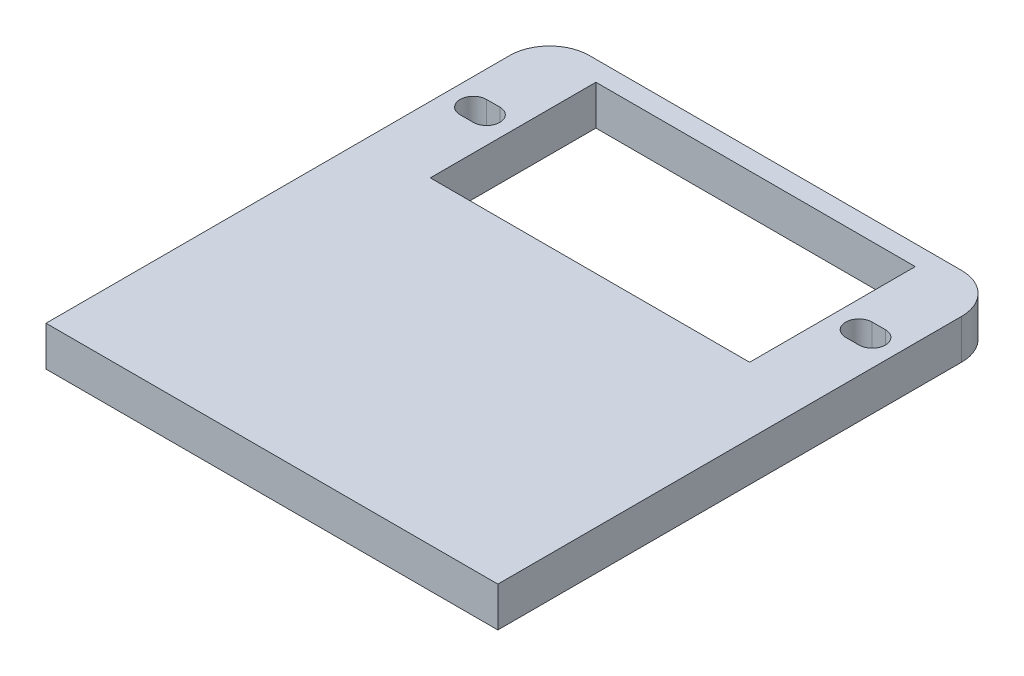
ISO-10303-21;
HEADER;
FILE_DESCRIPTION(('STEP AP214'),'2;1');
FILE_NAME('part.step','',(''),(''),'','','');
FILE_SCHEMA(('AUTOMOTIVE_DESIGN { 1 0 10303 214 1 1 1 1 }'));
ENDSEC;
DATA;
#1=APPLICATION_CONTEXT('core data for automotive mechanical design processes');
#2=APPLICATION_PROTOCOL_DEFINITION('international standard','automotive_design',2000,#1);
#3=PRODUCT_CONTEXT('',#1,'mechanical');
#4=PRODUCT('Part','Part','',(#3));
#5=PRODUCT_RELATED_PRODUCT_CATEGORY('part','',(#4));
#6=PRODUCT_DEFINITION_FORMATION('','',#4);
#7=PRODUCT_DEFINITION_CONTEXT('part definition',#1,'design');
#8=PRODUCT_DEFINITION('design','',#6,#7);
#9=PRODUCT_DEFINITION_SHAPE('','',#8);
#10=(LENGTH_UNIT() NAMED_UNIT(*) SI_UNIT(.MILLI.,.METRE.));
#11=(NAMED_UNIT(*) PLANE_ANGLE_UNIT() SI_UNIT($,.RADIAN.));
#12=(NAMED_UNIT(*) SI_UNIT($,.STERADIAN.) SOLID_ANGLE_UNIT());
#13=UNCERTAINTY_MEASURE_WITH_UNIT(LENGTH_MEASURE(1.E-05),#10,'distance_accuracy_value','');
#14=(GEOMETRIC_REPRESENTATION_CONTEXT(3) GLOBAL_UNCERTAINTY_ASSIGNED_CONTEXT((#13)) GLOBAL_UNIT_ASSIGNED_CONTEXT((#10,
#11,#12)) REPRESENTATION_CONTEXT('',''));
#15=CARTESIAN_POINT('',(0.,0.,0.));
#16=DIRECTION('',(0.,0.,1.));
#17=DIRECTION('',(1.,0.,0.));
#18=AXIS2_PLACEMENT_3D('',#15,#16,#17);
#19=CARTESIAN_POINT('',(0.,3.,-24.));
#20=DIRECTION('',(0.,0.,1.));
#21=DIRECTION('',(1.,0.,0.));
#22=AXIS2_PLACEMENT_3D('',#19,#20,#21);
#23=PLANE('',#22);
#24=DIRECTION('',(-1.,0.,0.));
#25=VECTOR('',#24,1.);
#26=CARTESIAN_POINT('',(0.,0.,-24.));
#27=LINE('',#26,#25);
#28=CARTESIAN_POINT('',(12.05,0.,-24.));
#29=VERTEX_POINT('',#28);
#30=CARTESIAN_POINT('',(-12.05,0.,-24.));
#31=VERTEX_POINT('',#30);
#32=EDGE_CURVE('E263',#29,#31,#27,.T.);
#33=ORIENTED_EDGE('',*,*,#32,.T.);
#34=DIRECTION('',(0.,-1.,0.));
#35=VECTOR('',#34,1.);
#36=CARTESIAN_POINT('',(-12.05,3.,-24.));
#37=LINE('',#36,#35);
#38=CARTESIAN_POINT('',(-12.05,3.,-24.));
#39=VERTEX_POINT('',#38);
#40=EDGE_CURVE('E283',#39,#31,#37,.T.);
#41=ORIENTED_EDGE('',*,*,#40,.F.);
#42=DIRECTION('',(-1.,0.,0.));
#43=VECTOR('',#42,1.);
#44=CARTESIAN_POINT('',(0.,3.,-24.));
#45=LINE('',#44,#43);
#46=CARTESIAN_POINT('',(12.05,3.,-24.));
#47=VERTEX_POINT('',#46);
#48=EDGE_CURVE('E235',#47,#39,#45,.T.);
#49=ORIENTED_EDGE('',*,*,#48,.F.);
#50=DIRECTION('',(0.,-1.,0.));
#51=VECTOR('',#50,1.);
#52=CARTESIAN_POINT('',(12.05,3.,-24.));
#53=LINE('',#52,#51);
#54=EDGE_CURVE('E180',#47,#29,#53,.T.);
#55=ORIENTED_EDGE('',*,*,#54,.T.);
#56=EDGE_LOOP('',(#33,#41,#49,#55));
#57=FACE_BOUND('',#56,.T.);
#58=ADVANCED_FACE('F35',(#57),#23,.F.);
#59=CARTESIAN_POINT('',(-12.05,3.,0.));
#60=DIRECTION('',(1.,0.,0.));
#61=DIRECTION('',(0.,0.,-1.));
#62=AXIS2_PLACEMENT_3D('',#59,#60,#61);
#63=PLANE('',#62);
#64=DIRECTION('',(0.,0.,1.));
#65=VECTOR('',#64,1.);
#66=CARTESIAN_POINT('',(-12.05,0.,0.));
#67=LINE('',#66,#65);
#68=CARTESIAN_POINT('',(-12.05,0.,-36.5));
#69=VERTEX_POINT('',#68);
#70=EDGE_CURVE('E266',#69,#31,#67,.T.);
#71=ORIENTED_EDGE('',*,*,#70,.F.);
#72=DIRECTION('',(0.,-1.,0.));
#73=VECTOR('',#72,1.);
#74=CARTESIAN_POINT('',(-12.05,3.,-36.5));
#75=LINE('',#74,#73);
#76=CARTESIAN_POINT('',(-12.05,3.,-36.5));
#77=VERTEX_POINT('',#76);
#78=EDGE_CURVE('E280',#77,#69,#75,.T.);
#79=ORIENTED_EDGE('',*,*,#78,.F.);
#80=DIRECTION('',(0.,0.,1.));
#81=VECTOR('',#80,1.);
#82=CARTESIAN_POINT('',(-12.05,3.,0.));
#83=LINE('',#82,#81);
#84=EDGE_CURVE('E237',#77,#39,#83,.T.);
#85=ORIENTED_EDGE('',*,*,#84,.T.);
#86=ORIENTED_EDGE('',*,*,#40,.T.);
#87=EDGE_LOOP('',(#71,#79,#85,#86));
#88=FACE_BOUND('',#87,.T.);
#89=ADVANCED_FACE('F326',(#88),#63,.T.);
#90=CARTESIAN_POINT('',(0.,3.,-36.5));
#91=DIRECTION('',(0.,0.,1.));
#92=DIRECTION('',(1.,0.,0.));
#93=AXIS2_PLACEMENT_3D('',#90,#91,#92);
#94=PLANE('',#93);
#95=DIRECTION('',(-1.,0.,0.));
#96=VECTOR('',#95,1.);
#97=CARTESIAN_POINT('',(0.,0.,-36.5));
#98=LINE('',#97,#96);
#99=CARTESIAN_POINT('',(12.05,0.,-36.5));
#100=VERTEX_POINT('',#99);
#101=EDGE_CURVE('E269',#100,#69,#98,.T.);
#102=ORIENTED_EDGE('',*,*,#101,.F.);
#103=DIRECTION('',(0.,-1.,0.));
#104=VECTOR('',#103,1.);
#105=CARTESIAN_POINT('',(12.05,3.,-36.5));
#106=LINE('',#105,#104);
#107=CARTESIAN_POINT('',(12.05,3.,-36.5));
#108=VERTEX_POINT('',#107);
#109=EDGE_CURVE('E211',#108,#100,#106,.T.);
#110=ORIENTED_EDGE('',*,*,#109,.F.);
#111=DIRECTION('',(-1.,0.,0.));
#112=VECTOR('',#111,1.);
#113=CARTESIAN_POINT('',(0.,3.,-36.5));
#114=LINE('',#113,#112);
#115=EDGE_CURVE('E240',#108,#77,#114,.T.);
#116=ORIENTED_EDGE('',*,*,#115,.T.);
#117=ORIENTED_EDGE('',*,*,#78,.T.);
#118=EDGE_LOOP('',(#102,#110,#116,#117));
#119=FACE_BOUND('',#118,.T.);
#120=ADVANCED_FACE('F332',(#119),#94,.T.);
#121=CARTESIAN_POINT('',(0.,3.,-38.));
#122=DIRECTION('',(0.,0.,1.));
#123=DIRECTION('',(1.,0.,0.));
#124=AXIS2_PLACEMENT_3D('',#121,#122,#123);
#125=PLANE('',#124);
#126=DIRECTION('',(-1.,0.,0.));
#127=VECTOR('',#126,1.);
#128=CARTESIAN_POINT('',(0.,0.,-38.));
#129=LINE('',#128,#127);
#130=CARTESIAN_POINT('',(14.05,0.,-38.));
#131=VERTEX_POINT('',#130);
#132=CARTESIAN_POINT('',(-14.05,0.,-38.));
#133=VERTEX_POINT('',#132);
#134=EDGE_CURVE('E272',#131,#133,#129,.T.);
#135=ORIENTED_EDGE('',*,*,#134,.T.);
#136=DIRECTION('',(0.,-1.,0.));
#137=VECTOR('',#136,1.);
#138=CARTESIAN_POINT('',(-14.05,3.,-38.));
#139=LINE('',#138,#137);
#140=CARTESIAN_POINT('',(-14.05,3.,-38.));
#141=VERTEX_POINT('',#140);
#142=EDGE_CURVE('E43',#133,#141,#139,.F.);
#143=ORIENTED_EDGE('',*,*,#142,.T.);
#144=DIRECTION('',(-1.,0.,0.));
#145=VECTOR('',#144,1.);
#146=CARTESIAN_POINT('',(0.,3.,-38.));
#147=LINE('',#146,#145);
#148=CARTESIAN_POINT('',(14.05,3.,-38.));
#149=VERTEX_POINT('',#148);
#150=EDGE_CURVE('E243',#149,#141,#147,.T.);
#151=ORIENTED_EDGE('',*,*,#150,.F.);
#152=DIRECTION('',(0.,-1.,0.));
#153=VECTOR('',#152,1.);
#154=CARTESIAN_POINT('',(14.05,3.,-38.));
#155=LINE('',#154,#153);
#156=EDGE_CURVE('E285',#149,#131,#155,.T.);
#157=ORIENTED_EDGE('',*,*,#156,.T.);
#158=EDGE_LOOP('',(#135,#143,#151,#157));
#159=FACE_BOUND('',#158,.T.);
#160=ADVANCED_FACE('F355',(#159),#125,.F.);
#161=CARTESIAN_POINT('',(-17.05,3.,0.));
#162=DIRECTION('',(-1.,0.,0.));
#163=DIRECTION('',(0.,0.,1.));
#164=AXIS2_PLACEMENT_3D('',#161,#162,#163);
#165=PLANE('',#164);
#166=DIRECTION('',(0.,0.,-1.));
#167=VECTOR('',#166,1.);
#168=CARTESIAN_POINT('',(-17.05,3.,0.));
#169=LINE('',#168,#167);
#170=CARTESIAN_POINT('',(-17.05,3.,0.));
#171=VERTEX_POINT('',#170);
#172=CARTESIAN_POINT('',(-17.05,3.,-35.));
#173=VERTEX_POINT('',#172);
#174=EDGE_CURVE('E245',#171,#173,#169,.T.);
#175=ORIENTED_EDGE('',*,*,#174,.T.);
#176=DIRECTION('',(0.,-1.,0.));
#177=VECTOR('',#176,1.);
#178=CARTESIAN_POINT('',(-17.05,0.,-35.));
#179=LINE('',#178,#177);
#180=CARTESIAN_POINT('',(-17.05,0.,-35.));
#181=VERTEX_POINT('',#180);
#182=EDGE_CURVE('E300',#173,#181,#179,.T.);
#183=ORIENTED_EDGE('',*,*,#182,.T.);
#184=DIRECTION('',(0.,0.,-1.));
#185=VECTOR('',#184,1.);
#186=CARTESIAN_POINT('',(-17.05,0.,0.));
#187=LINE('',#186,#185);
#188=CARTESIAN_POINT('',(-17.05,0.,0.));
#189=VERTEX_POINT('',#188);
#190=EDGE_CURVE('E274',#189,#181,#187,.T.);
#191=ORIENTED_EDGE('',*,*,#190,.F.);
#192=DIRECTION('',(0.,-1.,0.));
#193=VECTOR('',#192,1.);
#194=CARTESIAN_POINT('',(-17.05,3.,0.));
#195=LINE('',#194,#193);
#196=EDGE_CURVE('E278',#171,#189,#195,.T.);
#197=ORIENTED_EDGE('',*,*,#196,.F.);
#198=EDGE_LOOP('',(#175,#183,#191,#197));
#199=FACE_BOUND('',#198,.T.);
#200=ADVANCED_FACE('F306',(#199),#165,.T.);
#201=CARTESIAN_POINT('',(-14.05,3.,-30.25));
#202=DIRECTION('',(0.,-1.,0.));
#203=DIRECTION('',(0.,0.,-1.));
#204=AXIS2_PLACEMENT_3D('',#201,#202,#203);
#205=CYLINDRICAL_SURFACE('',#204,1.);
#206=CARTESIAN_POINT('',(-14.05,0.,-30.25));
#207=DIRECTION('',(0.,1.,0.));
#208=DIRECTION('',(0.,0.,1.));
#209=AXIS2_PLACEMENT_3D('',#206,#207,#208);
#210=CIRCLE('',#209,1.);
#211=CARTESIAN_POINT('',(-14.05,0.,-29.25));
#212=VERTEX_POINT('',#211);
#213=CARTESIAN_POINT('',(-14.05,0.,-31.25));
#214=VERTEX_POINT('',#213);
#215=EDGE_CURVE('E217',#212,#214,#210,.T.);
#216=ORIENTED_EDGE('',*,*,#215,.F.);
#217=DIRECTION('',(0.,-1.,0.));
#218=VECTOR('',#217,1.);
#219=CARTESIAN_POINT('',(-14.05,3.,-29.25));
#220=LINE('',#219,#218);
#221=CARTESIAN_POINT('',(-14.05,3.,-29.25));
#222=VERTEX_POINT('',#221);
#223=EDGE_CURVE('E281',#222,#212,#220,.T.);
#224=ORIENTED_EDGE('',*,*,#223,.F.);
#225=CARTESIAN_POINT('',(-14.05,3.,-30.25));
#226=DIRECTION('',(0.,1.,0.));
#227=DIRECTION('',(0.,0.,1.));
#228=AXIS2_PLACEMENT_3D('',#225,#226,#227);
#229=CIRCLE('',#228,1.);
#230=CARTESIAN_POINT('',(-14.05,3.,-31.25));
#231=VERTEX_POINT('',#230);
#232=EDGE_CURVE('E223',#222,#231,#229,.T.);
#233=ORIENTED_EDGE('',*,*,#232,.T.);
#234=DIRECTION('',(0.,-1.,0.));
#235=VECTOR('',#234,1.);
#236=CARTESIAN_POINT('',(-14.05,3.,-31.25));
#237=LINE('',#236,#235);
#238=EDGE_CURVE('E251',#231,#214,#237,.T.);
#239=ORIENTED_EDGE('',*,*,#238,.T.);
#240=EDGE_LOOP('',(#216,#224,#233,#239));
#241=FACE_BOUND('',#240,.T.);
#242=ADVANCED_FACE('F348',(#241),#205,.F.);
#243=CARTESIAN_POINT('',(1.01481323344643E-13,3.,-29.2499999999999));
#244=DIRECTION('',(0.,0.,-1.));
#245=DIRECTION('',(-1.,0.,0.));
#246=AXIS2_PLACEMENT_3D('',#243,#244,#245);
#247=PLANE('',#246);
#248=DIRECTION('',(1.,0.,0.));
#249=VECTOR('',#248,1.);
#250=CARTESIAN_POINT('',(1.01481323344643E-13,0.,-29.2499999999999));
#251=LINE('',#250,#249);
#252=CARTESIAN_POINT('',(-15.05,0.,-29.25));
#253=VERTEX_POINT('',#252);
#254=EDGE_CURVE('E254',#253,#212,#251,.T.);
#255=ORIENTED_EDGE('',*,*,#254,.F.);
#256=DIRECTION('',(0.,-1.,0.));
#257=VECTOR('',#256,1.);
#258=CARTESIAN_POINT('',(-15.05,3.,-29.25));
#259=LINE('',#258,#257);
#260=CARTESIAN_POINT('',(-15.05,3.,-29.25));
#261=VERTEX_POINT('',#260);
#262=EDGE_CURVE('E289',#261,#253,#259,.T.);
#263=ORIENTED_EDGE('',*,*,#262,.F.);
#264=DIRECTION('',(1.,0.,0.));
#265=VECTOR('',#264,1.);
#266=CARTESIAN_POINT('',(1.01481323344643E-13,3.,-29.2499999999999));
#267=LINE('',#266,#265);
#268=EDGE_CURVE('E226',#261,#222,#267,.T.);
#269=ORIENTED_EDGE('',*,*,#268,.T.);
#270=ORIENTED_EDGE('',*,*,#223,.T.);
#271=EDGE_LOOP('',(#255,#263,#269,#270));
#272=FACE_BOUND('',#271,.T.);
#273=ADVANCED_FACE('F344',(#272),#247,.T.);
#274=CARTESIAN_POINT('',(-15.05,3.,-30.25));
#275=DIRECTION('',(0.,-1.,0.));
#276=DIRECTION('',(0.,0.,-1.));
#277=AXIS2_PLACEMENT_3D('',#274,#275,#276);
#278=CYLINDRICAL_SURFACE('',#277,1.);
#279=CARTESIAN_POINT('',(-15.05,0.,-30.25));
#280=DIRECTION('',(0.,1.,0.));
#281=DIRECTION('',(0.,0.,1.));
#282=AXIS2_PLACEMENT_3D('',#279,#280,#281);
#283=CIRCLE('',#282,1.);
#284=CARTESIAN_POINT('',(-15.05,0.,-31.25));
#285=VERTEX_POINT('',#284);
#286=EDGE_CURVE('E257',#285,#253,#283,.T.);
#287=ORIENTED_EDGE('',*,*,#286,.F.);
#288=DIRECTION('',(0.,-1.,0.));
#289=VECTOR('',#288,1.);
#290=CARTESIAN_POINT('',(-15.05,3.,-31.25));
#291=LINE('',#290,#289);
#292=CARTESIAN_POINT('',(-15.05,3.,-31.25));
#293=VERTEX_POINT('',#292);
#294=EDGE_CURVE('E287',#293,#285,#291,.T.);
#295=ORIENTED_EDGE('',*,*,#294,.F.);
#296=CARTESIAN_POINT('',(-15.05,3.,-30.25));
#297=DIRECTION('',(0.,1.,0.));
#298=DIRECTION('',(0.,0.,1.));
#299=AXIS2_PLACEMENT_3D('',#296,#297,#298);
#300=CIRCLE('',#299,1.);
#301=EDGE_CURVE('E230',#293,#261,#300,.T.);
#302=ORIENTED_EDGE('',*,*,#301,.T.);
#303=ORIENTED_EDGE('',*,*,#262,.T.);
#304=EDGE_LOOP('',(#287,#295,#302,#303));
#305=FACE_BOUND('',#304,.T.);
#306=ADVANCED_FACE('F340',(#305),#278,.F.);
#307=CARTESIAN_POINT('',(-1.08420217248551E-13,3.,-31.25));
#308=DIRECTION('',(0.,0.,-1.));
#309=DIRECTION('',(-1.,0.,0.));
#310=AXIS2_PLACEMENT_3D('',#307,#308,#309);
#311=PLANE('',#310);
#312=DIRECTION('',(1.,0.,0.));
#313=VECTOR('',#312,1.);
#314=CARTESIAN_POINT('',(-1.08420217248551E-13,0.,-31.25));
#315=LINE('',#314,#313);
#316=EDGE_CURVE('E260',#285,#214,#315,.T.);
#317=ORIENTED_EDGE('',*,*,#316,.T.);
#318=ORIENTED_EDGE('',*,*,#238,.F.);
#319=DIRECTION('',(1.,0.,0.));
#320=VECTOR('',#319,1.);
#321=CARTESIAN_POINT('',(-1.08420217248551E-13,3.,-31.25));
#322=LINE('',#321,#320);
#323=EDGE_CURVE('E233',#293,#231,#322,.T.);
#324=ORIENTED_EDGE('',*,*,#323,.F.);
#325=ORIENTED_EDGE('',*,*,#294,.T.);
#326=EDGE_LOOP('',(#317,#318,#324,#325));
#327=FACE_BOUND('',#326,.T.);
#328=ADVANCED_FACE('F337',(#327),#311,.F.);
#329=CARTESIAN_POINT('',(0.,3.,0.));
#330=DIRECTION('',(0.,0.,1.));
#331=DIRECTION('',(1.,0.,0.));
#332=AXIS2_PLACEMENT_3D('',#329,#330,#331);
#333=PLANE('',#332);
#334=DIRECTION('',(-1.,0.,0.));
#335=VECTOR('',#334,1.);
#336=CARTESIAN_POINT('',(0.,0.,0.));
#337=LINE('',#336,#335);
#338=CARTESIAN_POINT('',(17.05,0.,0.));
#339=VERTEX_POINT('',#338);
#340=EDGE_CURVE('E227',#339,#189,#337,.T.);
#341=ORIENTED_EDGE('',*,*,#340,.F.);
#342=DIRECTION('',(0.,-1.,0.));
#343=VECTOR('',#342,1.);
#344=CARTESIAN_POINT('',(17.05,3.,0.));
#345=LINE('',#344,#343);
#346=CARTESIAN_POINT('',(17.05,3.,0.));
#347=VERTEX_POINT('',#346);
#348=EDGE_CURVE('E214',#347,#339,#345,.T.);
#349=ORIENTED_EDGE('',*,*,#348,.F.);
#350=DIRECTION('',(-1.,0.,0.));
#351=VECTOR('',#350,1.);
#352=CARTESIAN_POINT('',(0.,3.,0.));
#353=LINE('',#352,#351);
#354=EDGE_CURVE('E248',#347,#171,#353,.T.);
#355=ORIENTED_EDGE('',*,*,#354,.T.);
#356=ORIENTED_EDGE('',*,*,#196,.T.);
#357=EDGE_LOOP('',(#341,#349,#355,#356));
#358=FACE_BOUND('',#357,.T.);
#359=ADVANCED_FACE('F315',(#358),#333,.T.);
#360=CARTESIAN_POINT('',(0.,3.,0.));
#361=DIRECTION('',(0.,1.,0.));
#362=DIRECTION('',(0.,0.,1.));
#363=AXIS2_PLACEMENT_3D('',#360,#361,#362);
#364=PLANE('',#363);
#365=DIRECTION('',(0.,0.,1.));
#366=VECTOR('',#365,1.);
#367=CARTESIAN_POINT('',(12.05,3.,0.));
#368=LINE('',#367,#366);
#369=EDGE_CURVE('E193',#108,#47,#368,.T.);
#370=ORIENTED_EDGE('',*,*,#369,.T.);
#371=ORIENTED_EDGE('',*,*,#48,.T.);
#372=ORIENTED_EDGE('',*,*,#84,.F.);
#373=ORIENTED_EDGE('',*,*,#115,.F.);
#374=EDGE_LOOP('',(#370,#371,#372,#373));
#375=FACE_BOUND('',#374,.T.);
#376=ORIENTED_EDGE('',*,*,#232,.F.);
#377=ORIENTED_EDGE('',*,*,#268,.F.);
#378=ORIENTED_EDGE('',*,*,#301,.F.);
#379=ORIENTED_EDGE('',*,*,#323,.T.);
#380=EDGE_LOOP('',(#376,#377,#378,#379));
#381=FACE_BOUND('',#380,.T.);
#382=ORIENTED_EDGE('',*,*,#150,.T.);
#383=CARTESIAN_POINT('',(-14.05,3.,-35.));
#384=DIRECTION('',(0.,1.,0.));
#385=DIRECTION('',(0.,0.,1.));
#386=AXIS2_PLACEMENT_3D('',#383,#384,#385);
#387=CIRCLE('',#386,3.);
#388=EDGE_CURVE('E11',#141,#173,#387,.T.);
#389=ORIENTED_EDGE('',*,*,#388,.T.);
#390=ORIENTED_EDGE('',*,*,#174,.F.);
#391=ORIENTED_EDGE('',*,*,#354,.F.);
#392=DIRECTION('',(0.,0.,-1.));
#393=VECTOR('',#392,1.);
#394=CARTESIAN_POINT('',(17.05,3.,0.));
#395=LINE('',#394,#393);
#396=CARTESIAN_POINT('',(17.05,3.,-35.));
#397=VERTEX_POINT('',#396);
#398=EDGE_CURVE('E190',#347,#397,#395,.T.);
#399=ORIENTED_EDGE('',*,*,#398,.T.);
#400=CARTESIAN_POINT('',(14.05,3.,-35.));
#401=DIRECTION('',(0.,1.,0.));
#402=DIRECTION('',(0.,0.,1.));
#403=AXIS2_PLACEMENT_3D('',#400,#401,#402);
#404=CIRCLE('',#403,3.);
#405=EDGE_CURVE('E298',#397,#149,#404,.T.);
#406=ORIENTED_EDGE('',*,*,#405,.T.);
#407=EDGE_LOOP('',(#382,#389,#390,#391,#399,#406));
#408=FACE_BOUND('',#407,.T.);
#409=CARTESIAN_POINT('',(14.05,3.,-30.25));
#410=DIRECTION('',(0.,-1.,0.));
#411=DIRECTION('',(0.,0.,1.));
#412=AXIS2_PLACEMENT_3D('',#409,#410,#411);
#413=CIRCLE('',#412,1.);
#414=CARTESIAN_POINT('',(14.05,3.,-29.25));
#415=VERTEX_POINT('',#414);
#416=CARTESIAN_POINT('',(14.05,3.,-31.25));
#417=VERTEX_POINT('',#416);
#418=EDGE_CURVE('E160',#415,#417,#413,.T.);
#419=ORIENTED_EDGE('',*,*,#418,.T.);
#420=DIRECTION('',(-1.,0.,0.));
#421=VECTOR('',#420,1.);
#422=CARTESIAN_POINT('',(1.08420217248551E-13,3.,-31.25));
#423=LINE('',#422,#421);
#424=CARTESIAN_POINT('',(15.05,3.,-31.25));
#425=VERTEX_POINT('',#424);
#426=EDGE_CURVE('E164',#425,#417,#423,.T.);
#427=ORIENTED_EDGE('',*,*,#426,.F.);
#428=CARTESIAN_POINT('',(15.05,3.,-30.25));
#429=DIRECTION('',(0.,-1.,0.));
#430=DIRECTION('',(0.,0.,1.));
#431=AXIS2_PLACEMENT_3D('',#428,#429,#430);
#432=CIRCLE('',#431,1.);
#433=CARTESIAN_POINT('',(15.05,3.,-29.25));
#434=VERTEX_POINT('',#433);
#435=EDGE_CURVE('E185',#425,#434,#432,.T.);
#436=ORIENTED_EDGE('',*,*,#435,.T.);
#437=DIRECTION('',(-1.,0.,0.));
#438=VECTOR('',#437,1.);
#439=CARTESIAN_POINT('',(-1.01481323344643E-13,3.,-29.2499999999999));
#440=LINE('',#439,#438);
#441=EDGE_CURVE('E166',#434,#415,#440,.T.);
#442=ORIENTED_EDGE('',*,*,#441,.T.);
#443=EDGE_LOOP('',(#419,#427,#436,#442));
#444=FACE_BOUND('',#443,.T.);
#445=ADVANCED_FACE('F162',(#375,#381,#408,#444),#364,.T.);
#446=CARTESIAN_POINT('',(0.,0.,0.));
#447=DIRECTION('',(0.,1.,0.));
#448=DIRECTION('',(0.,0.,1.));
#449=AXIS2_PLACEMENT_3D('',#446,#447,#448);
#450=PLANE('',#449);
#451=ORIENTED_EDGE('',*,*,#32,.F.);
#452=DIRECTION('',(0.,0.,1.));
#453=VECTOR('',#452,1.);
#454=CARTESIAN_POINT('',(12.05,0.,0.));
#455=LINE('',#454,#453);
#456=EDGE_CURVE('E170',#100,#29,#455,.T.);
#457=ORIENTED_EDGE('',*,*,#456,.F.);
#458=ORIENTED_EDGE('',*,*,#101,.T.);
#459=ORIENTED_EDGE('',*,*,#70,.T.);
#460=EDGE_LOOP('',(#451,#457,#458,#459));
#461=FACE_BOUND('',#460,.T.);
#462=ORIENTED_EDGE('',*,*,#215,.T.);
#463=ORIENTED_EDGE('',*,*,#316,.F.);
#464=ORIENTED_EDGE('',*,*,#286,.T.);
#465=ORIENTED_EDGE('',*,*,#254,.T.);
#466=EDGE_LOOP('',(#462,#463,#464,#465));
#467=FACE_BOUND('',#466,.T.);
#468=ORIENTED_EDGE('',*,*,#190,.T.);
#469=CARTESIAN_POINT('',(-14.05,0.,-35.));
#470=DIRECTION('',(0.,1.,0.));
#471=DIRECTION('',(0.,0.,1.));
#472=AXIS2_PLACEMENT_3D('',#469,#470,#471);
#473=CIRCLE('',#472,3.);
#474=EDGE_CURVE('E57',#181,#133,#473,.F.);
#475=ORIENTED_EDGE('',*,*,#474,.T.);
#476=ORIENTED_EDGE('',*,*,#134,.F.);
#477=CARTESIAN_POINT('',(14.05,0.,-35.));
#478=DIRECTION('',(0.,1.,0.));
#479=DIRECTION('',(0.,0.,1.));
#480=AXIS2_PLACEMENT_3D('',#477,#478,#479);
#481=CIRCLE('',#480,3.);
#482=CARTESIAN_POINT('',(17.05,0.,-35.));
#483=VERTEX_POINT('',#482);
#484=EDGE_CURVE('E294',#131,#483,#481,.F.);
#485=ORIENTED_EDGE('',*,*,#484,.T.);
#486=DIRECTION('',(0.,0.,-1.));
#487=VECTOR('',#486,1.);
#488=CARTESIAN_POINT('',(17.05,0.,0.));
#489=LINE('',#488,#487);
#490=EDGE_CURVE('E204',#339,#483,#489,.T.);
#491=ORIENTED_EDGE('',*,*,#490,.F.);
#492=ORIENTED_EDGE('',*,*,#340,.T.);
#493=EDGE_LOOP('',(#468,#475,#476,#485,#491,#492));
#494=FACE_BOUND('',#493,.T.);
#495=CARTESIAN_POINT('',(14.05,0.,-30.25));
#496=DIRECTION('',(0.,-1.,0.));
#497=DIRECTION('',(0.,0.,1.));
#498=AXIS2_PLACEMENT_3D('',#495,#496,#497);
#499=CIRCLE('',#498,1.);
#500=CARTESIAN_POINT('',(14.05,0.,-29.25));
#501=VERTEX_POINT('',#500);
#502=CARTESIAN_POINT('',(14.05,0.,-31.25));
#503=VERTEX_POINT('',#502);
#504=EDGE_CURVE('E176',#501,#503,#499,.T.);
#505=ORIENTED_EDGE('',*,*,#504,.F.);
#506=DIRECTION('',(-1.,0.,0.));
#507=VECTOR('',#506,1.);
#508=CARTESIAN_POINT('',(-1.01481323344643E-13,0.,-29.2499999999999));
#509=LINE('',#508,#507);
#510=CARTESIAN_POINT('',(15.05,0.,-29.25));
#511=VERTEX_POINT('',#510);
#512=EDGE_CURVE('E202',#511,#501,#509,.T.);
#513=ORIENTED_EDGE('',*,*,#512,.F.);
#514=CARTESIAN_POINT('',(15.05,0.,-30.25));
#515=DIRECTION('',(0.,-1.,0.));
#516=DIRECTION('',(0.,0.,1.));
#517=AXIS2_PLACEMENT_3D('',#514,#515,#516);
#518=CIRCLE('',#517,1.);
#519=CARTESIAN_POINT('',(15.05,0.,-31.25));
#520=VERTEX_POINT('',#519);
#521=EDGE_CURVE('E200',#520,#511,#518,.T.);
#522=ORIENTED_EDGE('',*,*,#521,.F.);
#523=DIRECTION('',(-1.,0.,0.));
#524=VECTOR('',#523,1.);
#525=CARTESIAN_POINT('',(1.08420217248551E-13,0.,-31.25));
#526=LINE('',#525,#524);
#527=EDGE_CURVE('E198',#520,#503,#526,.T.);
#528=ORIENTED_EDGE('',*,*,#527,.T.);
#529=EDGE_LOOP('',(#505,#513,#522,#528));
#530=FACE_BOUND('',#529,.T.);
#531=ADVANCED_FACE('F310',(#461,#467,#494,#530),#450,.F.);
#532=CARTESIAN_POINT('',(17.05,3.,0.));
#533=DIRECTION('',(-1.,0.,0.));
#534=DIRECTION('',(0.,0.,1.));
#535=AXIS2_PLACEMENT_3D('',#532,#533,#534);
#536=PLANE('',#535);
#537=ORIENTED_EDGE('',*,*,#490,.T.);
#538=DIRECTION('',(0.,-1.,0.));
#539=VECTOR('',#538,1.);
#540=CARTESIAN_POINT('',(17.05,3.,-35.));
#541=LINE('',#540,#539);
#542=EDGE_CURVE('E296',#483,#397,#541,.F.);
#543=ORIENTED_EDGE('',*,*,#542,.T.);
#544=ORIENTED_EDGE('',*,*,#398,.F.);
#545=ORIENTED_EDGE('',*,*,#348,.T.);
#546=EDGE_LOOP('',(#537,#543,#544,#545));
#547=FACE_BOUND('',#546,.T.);
#548=ADVANCED_FACE('F375',(#547),#536,.F.);
#549=CARTESIAN_POINT('',(12.05,3.,0.));
#550=DIRECTION('',(1.,0.,0.));
#551=DIRECTION('',(0.,0.,-1.));
#552=AXIS2_PLACEMENT_3D('',#549,#550,#551);
#553=PLANE('',#552);
#554=ORIENTED_EDGE('',*,*,#456,.T.);
#555=ORIENTED_EDGE('',*,*,#54,.F.);
#556=ORIENTED_EDGE('',*,*,#369,.F.);
#557=ORIENTED_EDGE('',*,*,#109,.T.);
#558=EDGE_LOOP('',(#554,#555,#556,#557));
#559=FACE_BOUND('',#558,.T.);
#560=ADVANCED_FACE('F393',(#559),#553,.F.);
#561=CARTESIAN_POINT('',(14.05,3.,-30.25));
#562=DIRECTION('',(0.,-1.,0.));
#563=DIRECTION('',(0.,0.,-1.));
#564=AXIS2_PLACEMENT_3D('',#561,#562,#563);
#565=CYLINDRICAL_SURFACE('',#564,1.);
#566=ORIENTED_EDGE('',*,*,#504,.T.);
#567=DIRECTION('',(0.,-1.,0.));
#568=VECTOR('',#567,1.);
#569=CARTESIAN_POINT('',(14.05,3.,-31.25));
#570=LINE('',#569,#568);
#571=EDGE_CURVE('E173',#417,#503,#570,.T.);
#572=ORIENTED_EDGE('',*,*,#571,.F.);
#573=ORIENTED_EDGE('',*,*,#418,.F.);
#574=DIRECTION('',(0.,-1.,0.));
#575=VECTOR('',#574,1.);
#576=CARTESIAN_POINT('',(14.05,3.,-29.25));
#577=LINE('',#576,#575);
#578=EDGE_CURVE('E196',#415,#501,#577,.T.);
#579=ORIENTED_EDGE('',*,*,#578,.T.);
#580=EDGE_LOOP('',(#566,#572,#573,#579));
#581=FACE_BOUND('',#580,.T.);
#582=ADVANCED_FACE('F174',(#581),#565,.F.);
#583=CARTESIAN_POINT('',(1.08420217248551E-13,3.,-31.25));
#584=DIRECTION('',(0.,0.,1.));
#585=DIRECTION('',(1.,0.,0.));
#586=AXIS2_PLACEMENT_3D('',#583,#584,#585);
#587=PLANE('',#586);
#588=ORIENTED_EDGE('',*,*,#527,.F.);
#589=DIRECTION('',(0.,-1.,0.));
#590=VECTOR('',#589,1.);
#591=CARTESIAN_POINT('',(15.05,3.,-31.25));
#592=LINE('',#591,#590);
#593=EDGE_CURVE('E181',#425,#520,#592,.T.);
#594=ORIENTED_EDGE('',*,*,#593,.F.);
#595=ORIENTED_EDGE('',*,*,#426,.T.);
#596=ORIENTED_EDGE('',*,*,#571,.T.);
#597=EDGE_LOOP('',(#588,#594,#595,#596));
#598=FACE_BOUND('',#597,.T.);
#599=ADVANCED_FACE('F183',(#598),#587,.T.);
#600=CARTESIAN_POINT('',(15.05,3.,-30.25));
#601=DIRECTION('',(0.,-1.,0.));
#602=DIRECTION('',(0.,0.,-1.));
#603=AXIS2_PLACEMENT_3D('',#600,#601,#602);
#604=CYLINDRICAL_SURFACE('',#603,1.);
#605=ORIENTED_EDGE('',*,*,#521,.T.);
#606=DIRECTION('',(0.,-1.,0.));
#607=VECTOR('',#606,1.);
#608=CARTESIAN_POINT('',(15.05,3.,-29.25));
#609=LINE('',#608,#607);
#610=EDGE_CURVE('E219',#434,#511,#609,.T.);
#611=ORIENTED_EDGE('',*,*,#610,.F.);
#612=ORIENTED_EDGE('',*,*,#435,.F.);
#613=ORIENTED_EDGE('',*,*,#593,.T.);
#614=EDGE_LOOP('',(#605,#611,#612,#613));
#615=FACE_BOUND('',#614,.T.);
#616=ADVANCED_FACE('F407',(#615),#604,.F.);
#617=CARTESIAN_POINT('',(-1.01481323344643E-13,3.,-29.2499999999999));
#618=DIRECTION('',(0.,0.,1.));
#619=DIRECTION('',(1.,0.,0.));
#620=AXIS2_PLACEMENT_3D('',#617,#618,#619);
#621=PLANE('',#620);
#622=ORIENTED_EDGE('',*,*,#512,.T.);
#623=ORIENTED_EDGE('',*,*,#578,.F.);
#624=ORIENTED_EDGE('',*,*,#441,.F.);
#625=ORIENTED_EDGE('',*,*,#610,.T.);
#626=EDGE_LOOP('',(#622,#623,#624,#625));
#627=FACE_BOUND('',#626,.T.);
#628=ADVANCED_FACE('F323',(#627),#621,.F.);
#629=CARTESIAN_POINT('',(14.05,3.,-35.));
#630=DIRECTION('',(0.,-1.,0.));
#631=DIRECTION('',(0.,0.,-1.));
#632=AXIS2_PLACEMENT_3D('',#629,#630,#631);
#633=CYLINDRICAL_SURFACE('',#632,3.);
#634=ORIENTED_EDGE('',*,*,#405,.F.);
#635=ORIENTED_EDGE('',*,*,#542,.F.);
#636=ORIENTED_EDGE('',*,*,#484,.F.);
#637=ORIENTED_EDGE('',*,*,#156,.F.);
#638=EDGE_LOOP('',(#634,#635,#636,#637));
#639=FACE_BOUND('',#638,.T.);
#640=ADVANCED_FACE('F319',(#639),#633,.T.);
#641=CARTESIAN_POINT('',(-14.05,3.,-35.));
#642=DIRECTION('',(0.,1.,0.));
#643=DIRECTION('',(0.,0.,1.));
#644=AXIS2_PLACEMENT_3D('',#641,#642,#643);
#645=CYLINDRICAL_SURFACE('',#644,3.);
#646=ORIENTED_EDGE('',*,*,#388,.F.);
#647=ORIENTED_EDGE('',*,*,#142,.F.);
#648=ORIENTED_EDGE('',*,*,#474,.F.);
#649=ORIENTED_EDGE('',*,*,#182,.F.);
#650=EDGE_LOOP('',(#646,#647,#648,#649));
#651=FACE_BOUND('',#650,.T.);
#652=ADVANCED_FACE('F37',(#651),#645,.T.);
#653=CLOSED_SHELL('',(#58,#89,#120,#160,#200,#242,#273,#306,#328,#359,#445,#531,#548,#560,#582,
#599,#616,#628,#640,#652));
#654=MANIFOLD_SOLID_BREP('B2',#653);
#655=ADVANCED_BREP_SHAPE_REPRESENTATION('',(#18,#654),#14);
#656=SHAPE_DEFINITION_REPRESENTATION(#9,#655);
ENDSEC;
END-ISO-10303-21;
